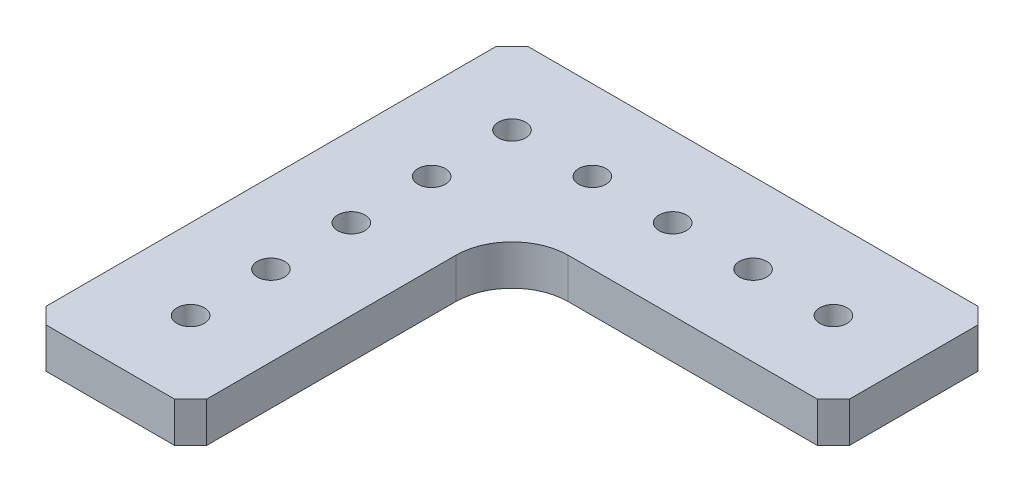
ISO-10303-21;
HEADER;
FILE_DESCRIPTION(('STEP AP214'),'2;1');
FILE_NAME('part.step','',(''),(''),'','','');
FILE_SCHEMA(('AUTOMOTIVE_DESIGN { 1 0 10303 214 1 1 1 1 }'));
ENDSEC;
DATA;
#1=APPLICATION_CONTEXT('core data for automotive mechanical design processes');
#2=APPLICATION_PROTOCOL_DEFINITION('international standard','automotive_design',2000,#1);
#3=PRODUCT_CONTEXT('',#1,'mechanical');
#4=PRODUCT('Part','Part','',(#3));
#5=PRODUCT_RELATED_PRODUCT_CATEGORY('part','',(#4));
#6=PRODUCT_DEFINITION_FORMATION('','',#4);
#7=PRODUCT_DEFINITION_CONTEXT('part definition',#1,'design');
#8=PRODUCT_DEFINITION('design','',#6,#7);
#9=PRODUCT_DEFINITION_SHAPE('','',#8);
#10=(LENGTH_UNIT() NAMED_UNIT(*) SI_UNIT(.MILLI.,.METRE.));
#11=(NAMED_UNIT(*) PLANE_ANGLE_UNIT() SI_UNIT($,.RADIAN.));
#12=(NAMED_UNIT(*) SI_UNIT($,.STERADIAN.) SOLID_ANGLE_UNIT());
#13=UNCERTAINTY_MEASURE_WITH_UNIT(LENGTH_MEASURE(1.E-05),#10,'distance_accuracy_value','');
#14=(GEOMETRIC_REPRESENTATION_CONTEXT(3) GLOBAL_UNCERTAINTY_ASSIGNED_CONTEXT((#13)) GLOBAL_UNIT_ASSIGNED_CONTEXT((#10,
#11,#12)) REPRESENTATION_CONTEXT('',''));
#15=CARTESIAN_POINT('',(0.,0.,0.));
#16=DIRECTION('',(0.,0.,1.));
#17=DIRECTION('',(1.,0.,0.));
#18=AXIS2_PLACEMENT_3D('',#15,#16,#17);
#19=CARTESIAN_POINT('',(-20.5081481481481,6.35,0.));
#20=DIRECTION('',(-1.,0.,0.));
#21=DIRECTION('',(0.,0.,1.));
#22=AXIS2_PLACEMENT_3D('',#19,#20,#21);
#23=PLANE('',#22);
#24=DIRECTION('',(0.,0.,-1.));
#25=VECTOR('',#24,1.);
#26=CARTESIAN_POINT('',(-20.5081481481481,0.,0.));
#27=LINE('',#26,#25);
#28=CARTESIAN_POINT('',(-20.5081481481481,0.,27.892962962963));
#29=VERTEX_POINT('',#28);
#30=CARTESIAN_POINT('',(-20.5081481481481,0.,-11.477037037037));
#31=VERTEX_POINT('',#30);
#32=EDGE_CURVE('E136',#29,#31,#27,.T.);
#33=ORIENTED_EDGE('',*,*,#32,.T.);
#34=DIRECTION('',(0.,-1.,0.));
#35=VECTOR('',#34,1.);
#36=CARTESIAN_POINT('',(-20.5081481481481,6.35,-11.477037037037));
#37=LINE('',#36,#35);
#38=CARTESIAN_POINT('',(-20.5081481481481,6.35,-11.477037037037));
#39=VERTEX_POINT('',#38);
#40=EDGE_CURVE('E58',#31,#39,#37,.F.);
#41=ORIENTED_EDGE('',*,*,#40,.T.);
#42=DIRECTION('',(0.,0.,-1.));
#43=VECTOR('',#42,1.);
#44=CARTESIAN_POINT('',(-20.5081481481481,6.35,0.));
#45=LINE('',#44,#43);
#46=CARTESIAN_POINT('',(-20.5081481481481,6.35,27.892962962963));
#47=VERTEX_POINT('',#46);
#48=EDGE_CURVE('E137',#47,#39,#45,.T.);
#49=ORIENTED_EDGE('',*,*,#48,.F.);
#50=DIRECTION('',(0.,-1.,0.));
#51=VECTOR('',#50,1.);
#52=CARTESIAN_POINT('',(-20.5081481481481,6.35,27.892962962963));
#53=LINE('',#52,#51);
#54=EDGE_CURVE('E131',#47,#29,#53,.T.);
#55=ORIENTED_EDGE('',*,*,#54,.T.);
#56=EDGE_LOOP('',(#33,#41,#49,#55));
#57=FACE_BOUND('',#56,.T.);
#58=ADVANCED_FACE('F37',(#57),#23,.F.);
#59=CARTESIAN_POINT('',(0.,6.35,-20.367037037037));
#60=DIRECTION('',(0.,0.,-1.));
#61=DIRECTION('',(-1.,0.,0.));
#62=AXIS2_PLACEMENT_3D('',#59,#60,#61);
#63=PLANE('',#62);
#64=DIRECTION('',(1.,0.,0.));
#65=VECTOR('',#64,1.);
#66=CARTESIAN_POINT('',(0.,6.35,-20.367037037037));
#67=LINE('',#66,#65);
#68=CARTESIAN_POINT('',(-11.6181481481481,6.35,-20.367037037037));
#69=VERTEX_POINT('',#68);
#70=CARTESIAN_POINT('',(27.7518518518518,6.35,-20.367037037037));
#71=VERTEX_POINT('',#70);
#72=EDGE_CURVE('E212',#69,#71,#67,.T.);
#73=ORIENTED_EDGE('',*,*,#72,.F.);
#74=DIRECTION('',(0.,-1.,0.));
#75=VECTOR('',#74,1.);
#76=CARTESIAN_POINT('',(-11.6181481481481,0.,-20.367037037037));
#77=LINE('',#76,#75);
#78=CARTESIAN_POINT('',(-11.6181481481481,0.,-20.367037037037));
#79=VERTEX_POINT('',#78);
#80=EDGE_CURVE('E205',#69,#79,#77,.T.);
#81=ORIENTED_EDGE('',*,*,#80,.T.);
#82=DIRECTION('',(1.,0.,0.));
#83=VECTOR('',#82,1.);
#84=CARTESIAN_POINT('',(0.,0.,-20.367037037037));
#85=LINE('',#84,#83);
#86=CARTESIAN_POINT('',(27.7518518518518,0.,-20.367037037037));
#87=VERTEX_POINT('',#86);
#88=EDGE_CURVE('E142',#79,#87,#85,.T.);
#89=ORIENTED_EDGE('',*,*,#88,.T.);
#90=DIRECTION('',(0.,1.,0.));
#91=VECTOR('',#90,1.);
#92=CARTESIAN_POINT('',(27.7518518518518,6.35,-20.367037037037));
#93=LINE('',#92,#91);
#94=EDGE_CURVE('E169',#87,#71,#93,.T.);
#95=ORIENTED_EDGE('',*,*,#94,.T.);
#96=EDGE_LOOP('',(#73,#81,#89,#95));
#97=FACE_BOUND('',#96,.T.);
#98=ADVANCED_FACE('F211',(#97),#63,.F.);
#99=CARTESIAN_POINT('',(30.2918518518519,6.35,0.));
#100=DIRECTION('',(1.,0.,0.));
#101=DIRECTION('',(0.,0.,-1.));
#102=AXIS2_PLACEMENT_3D('',#99,#100,#101);
#103=PLANE('',#102);
#104=DIRECTION('',(0.,0.,1.));
#105=VECTOR('',#104,1.);
#106=CARTESIAN_POINT('',(30.2918518518519,0.,0.));
#107=LINE('',#106,#105);
#108=CARTESIAN_POINT('',(30.2918518518519,0.,-43.227037037037));
#109=VERTEX_POINT('',#108);
#110=CARTESIAN_POINT('',(30.2918518518519,0.,-22.907037037037));
#111=VERTEX_POINT('',#110);
#112=EDGE_CURVE('E145',#109,#111,#107,.T.);
#113=ORIENTED_EDGE('',*,*,#112,.F.);
#114=DIRECTION('',(0.,1.,0.));
#115=VECTOR('',#114,1.);
#116=CARTESIAN_POINT('',(30.2918518518519,6.35,-43.227037037037));
#117=LINE('',#116,#115);
#118=CARTESIAN_POINT('',(30.2918518518519,6.35,-43.227037037037));
#119=VERTEX_POINT('',#118);
#120=EDGE_CURVE('E180',#109,#119,#117,.T.);
#121=ORIENTED_EDGE('',*,*,#120,.T.);
#122=DIRECTION('',(0.,0.,1.));
#123=VECTOR('',#122,1.);
#124=CARTESIAN_POINT('',(30.2918518518519,6.35,0.));
#125=LINE('',#124,#123);
#126=CARTESIAN_POINT('',(30.2918518518519,6.35,-22.907037037037));
#127=VERTEX_POINT('',#126);
#128=EDGE_CURVE('E226',#119,#127,#125,.T.);
#129=ORIENTED_EDGE('',*,*,#128,.T.);
#130=DIRECTION('',(0.,-1.,0.));
#131=VECTOR('',#130,1.);
#132=CARTESIAN_POINT('',(30.2918518518519,0.,-22.907037037037));
#133=LINE('',#132,#131);
#134=EDGE_CURVE('E163',#127,#111,#133,.T.);
#135=ORIENTED_EDGE('',*,*,#134,.T.);
#136=EDGE_LOOP('',(#113,#121,#129,#135));
#137=FACE_BOUND('',#136,.T.);
#138=ADVANCED_FACE('F260',(#137),#103,.T.);
#139=CARTESIAN_POINT('',(0.,6.35,-45.767037037037));
#140=DIRECTION('',(0.,0.,-1.));
#141=DIRECTION('',(-1.,0.,0.));
#142=AXIS2_PLACEMENT_3D('',#139,#140,#141);
#143=PLANE('',#142);
#144=DIRECTION('',(1.,0.,0.));
#145=VECTOR('',#144,1.);
#146=CARTESIAN_POINT('',(0.,0.,-45.767037037037));
#147=LINE('',#146,#145);
#148=CARTESIAN_POINT('',(-43.3681481481481,0.,-45.767037037037));
#149=VERTEX_POINT('',#148);
#150=CARTESIAN_POINT('',(27.7518518518519,0.,-45.767037037037));
#151=VERTEX_POINT('',#150);
#152=EDGE_CURVE('E154',#149,#151,#147,.T.);
#153=ORIENTED_EDGE('',*,*,#152,.F.);
#154=DIRECTION('',(0.,1.,0.));
#155=VECTOR('',#154,1.);
#156=CARTESIAN_POINT('',(-43.3681481481481,6.35,-45.767037037037));
#157=LINE('',#156,#155);
#158=CARTESIAN_POINT('',(-43.3681481481481,6.35,-45.767037037037));
#159=VERTEX_POINT('',#158);
#160=EDGE_CURVE('E201',#149,#159,#157,.T.);
#161=ORIENTED_EDGE('',*,*,#160,.T.);
#162=DIRECTION('',(1.,0.,0.));
#163=VECTOR('',#162,1.);
#164=CARTESIAN_POINT('',(0.,6.35,-45.767037037037));
#165=LINE('',#164,#163);
#166=CARTESIAN_POINT('',(27.7518518518519,6.35,-45.767037037037));
#167=VERTEX_POINT('',#166);
#168=EDGE_CURVE('E229',#159,#167,#165,.T.);
#169=ORIENTED_EDGE('',*,*,#168,.T.);
#170=DIRECTION('',(0.,-1.,0.));
#171=VECTOR('',#170,1.);
#172=CARTESIAN_POINT('',(27.7518518518519,6.35,-45.767037037037));
#173=LINE('',#172,#171);
#174=EDGE_CURVE('E175',#167,#151,#173,.T.);
#175=ORIENTED_EDGE('',*,*,#174,.T.);
#176=EDGE_LOOP('',(#153,#161,#169,#175));
#177=FACE_BOUND('',#176,.T.);
#178=ADVANCED_FACE('F254',(#177),#143,.T.);
#179=CARTESIAN_POINT('',(-45.9081481481482,6.35,0.));
#180=DIRECTION('',(1.,0.,0.));
#181=DIRECTION('',(0.,0.,-1.));
#182=AXIS2_PLACEMENT_3D('',#179,#180,#181);
#183=PLANE('',#182);
#184=DIRECTION('',(0.,0.,1.));
#185=VECTOR('',#184,1.);
#186=CARTESIAN_POINT('',(-45.9081481481482,6.35,0.));
#187=LINE('',#186,#185);
#188=CARTESIAN_POINT('',(-45.9081481481482,6.35,-43.2270370370371));
#189=VERTEX_POINT('',#188);
#190=CARTESIAN_POINT('',(-45.9081481481482,6.35,27.8929629629629));
#191=VERTEX_POINT('',#190);
#192=EDGE_CURVE('E234',#189,#191,#187,.T.);
#193=ORIENTED_EDGE('',*,*,#192,.F.);
#194=DIRECTION('',(0.,-1.,0.));
#195=VECTOR('',#194,1.);
#196=CARTESIAN_POINT('',(-45.9081481481482,0.,-43.2270370370371));
#197=LINE('',#196,#195);
#198=CARTESIAN_POINT('',(-45.9081481481482,0.,-43.2270370370371));
#199=VERTEX_POINT('',#198);
#200=EDGE_CURVE('E196',#189,#199,#197,.T.);
#201=ORIENTED_EDGE('',*,*,#200,.T.);
#202=DIRECTION('',(0.,0.,1.));
#203=VECTOR('',#202,1.);
#204=CARTESIAN_POINT('',(-45.9081481481482,0.,0.));
#205=LINE('',#204,#203);
#206=CARTESIAN_POINT('',(-45.9081481481482,0.,27.8929629629629));
#207=VERTEX_POINT('',#206);
#208=EDGE_CURVE('E156',#199,#207,#205,.T.);
#209=ORIENTED_EDGE('',*,*,#208,.T.);
#210=DIRECTION('',(0.,1.,0.));
#211=VECTOR('',#210,1.);
#212=CARTESIAN_POINT('',(-45.9081481481482,6.35,27.8929629629629));
#213=LINE('',#212,#211);
#214=EDGE_CURVE('E191',#207,#191,#213,.T.);
#215=ORIENTED_EDGE('',*,*,#214,.T.);
#216=EDGE_LOOP('',(#193,#201,#209,#215));
#217=FACE_BOUND('',#216,.T.);
#218=ADVANCED_FACE('F245',(#217),#183,.F.);
#219=CARTESIAN_POINT('',(0.,6.35,30.432962962963));
#220=DIRECTION('',(0.,0.,-1.));
#221=DIRECTION('',(-1.,0.,0.));
#222=AXIS2_PLACEMENT_3D('',#219,#220,#221);
#223=PLANE('',#222);
#224=DIRECTION('',(1.,0.,0.));
#225=VECTOR('',#224,1.);
#226=CARTESIAN_POINT('',(0.,6.35,30.432962962963));
#227=LINE('',#226,#225);
#228=CARTESIAN_POINT('',(-43.3681481481482,6.35,30.432962962963));
#229=VERTEX_POINT('',#228);
#230=CARTESIAN_POINT('',(-23.0481481481482,6.35,30.432962962963));
#231=VERTEX_POINT('',#230);
#232=EDGE_CURVE('E138',#229,#231,#227,.T.);
#233=ORIENTED_EDGE('',*,*,#232,.F.);
#234=DIRECTION('',(0.,-1.,0.));
#235=VECTOR('',#234,1.);
#236=CARTESIAN_POINT('',(-43.3681481481482,6.35,30.432962962963));
#237=LINE('',#236,#235);
#238=CARTESIAN_POINT('',(-43.3681481481482,0.,30.432962962963));
#239=VERTEX_POINT('',#238);
#240=EDGE_CURVE('E185',#229,#239,#237,.T.);
#241=ORIENTED_EDGE('',*,*,#240,.T.);
#242=DIRECTION('',(1.,0.,0.));
#243=VECTOR('',#242,1.);
#244=CARTESIAN_POINT('',(0.,0.,30.432962962963));
#245=LINE('',#244,#243);
#246=CARTESIAN_POINT('',(-23.0481481481482,0.,30.432962962963));
#247=VERTEX_POINT('',#246);
#248=EDGE_CURVE('E158',#239,#247,#245,.T.);
#249=ORIENTED_EDGE('',*,*,#248,.T.);
#250=DIRECTION('',(0.,1.,0.));
#251=VECTOR('',#250,1.);
#252=CARTESIAN_POINT('',(-23.0481481481482,6.35,30.432962962963));
#253=LINE('',#252,#251);
#254=EDGE_CURVE('E133',#247,#231,#253,.T.);
#255=ORIENTED_EDGE('',*,*,#254,.T.);
#256=EDGE_LOOP('',(#233,#241,#249,#255));
#257=FACE_BOUND('',#256,.T.);
#258=ADVANCED_FACE('F240',(#257),#223,.F.);
#259=CARTESIAN_POINT('',(0.,6.35,0.));
#260=DIRECTION('',(0.,1.,0.));
#261=DIRECTION('',(0.,0.,1.));
#262=AXIS2_PLACEMENT_3D('',#259,#260,#261);
#263=PLANE('',#262);
#264=CARTESIAN_POINT('',(-33.2081481481478,6.35,17.7329629629629));
#265=DIRECTION('',(0.,1.,0.));
#266=DIRECTION('',(0.,0.,1.));
#267=AXIS2_PLACEMENT_3D('',#264,#265,#266);
#268=CIRCLE('',#267,2.159);
#269=CARTESIAN_POINT('',(-33.2081481481478,6.35,19.8919629629629));
#270=VERTEX_POINT('',#269);
#271=EDGE_CURVE('E491',#270,#270,#268,.T.);
#272=ORIENTED_EDGE('',*,*,#271,.F.);
#273=EDGE_LOOP('',(#272));
#274=FACE_BOUND('',#273,.T.);
#275=CARTESIAN_POINT('',(-33.2081481481479,6.35,5.03296296296295));
#276=DIRECTION('',(0.,1.,0.));
#277=DIRECTION('',(0.,0.,1.));
#278=AXIS2_PLACEMENT_3D('',#275,#276,#277);
#279=CIRCLE('',#278,2.159);
#280=CARTESIAN_POINT('',(-33.2081481481479,6.35,7.19196296296295));
#281=VERTEX_POINT('',#280);
#282=EDGE_CURVE('E495',#281,#281,#279,.T.);
#283=ORIENTED_EDGE('',*,*,#282,.F.);
#284=EDGE_LOOP('',(#283));
#285=FACE_BOUND('',#284,.T.);
#286=CARTESIAN_POINT('',(-33.208148148148,6.35,-7.66703703703705));
#287=DIRECTION('',(0.,1.,0.));
#288=DIRECTION('',(0.,0.,1.));
#289=AXIS2_PLACEMENT_3D('',#286,#287,#288);
#290=CIRCLE('',#289,2.159);
#291=CARTESIAN_POINT('',(-33.208148148148,6.35,-5.50803703703705));
#292=VERTEX_POINT('',#291);
#293=EDGE_CURVE('E534',#292,#292,#290,.T.);
#294=ORIENTED_EDGE('',*,*,#293,.F.);
#295=EDGE_LOOP('',(#294));
#296=FACE_BOUND('',#295,.T.);
#297=CARTESIAN_POINT('',(-33.2081481481482,6.35,-20.367037037037));
#298=DIRECTION('',(0.,1.,0.));
#299=DIRECTION('',(0.,0.,1.));
#300=AXIS2_PLACEMENT_3D('',#297,#298,#299);
#301=CIRCLE('',#300,2.159);
#302=CARTESIAN_POINT('',(-33.2081481481482,6.35,-18.208037037037));
#303=VERTEX_POINT('',#302);
#304=EDGE_CURVE('E528',#303,#303,#301,.T.);
#305=ORIENTED_EDGE('',*,*,#304,.F.);
#306=EDGE_LOOP('',(#305));
#307=FACE_BOUND('',#306,.T.);
#308=CARTESIAN_POINT('',(17.5918518518518,6.35,-33.067037037037));
#309=DIRECTION('',(0.,1.,0.));
#310=DIRECTION('',(0.,0.,1.));
#311=AXIS2_PLACEMENT_3D('',#308,#309,#310);
#312=CIRCLE('',#311,2.159);
#313=CARTESIAN_POINT('',(17.5918518518518,6.35,-30.908037037037));
#314=VERTEX_POINT('',#313);
#315=EDGE_CURVE('E522',#314,#314,#312,.T.);
#316=ORIENTED_EDGE('',*,*,#315,.F.);
#317=EDGE_LOOP('',(#316));
#318=FACE_BOUND('',#317,.T.);
#319=CARTESIAN_POINT('',(4.89185185185184,6.35,-33.067037037037));
#320=DIRECTION('',(0.,1.,0.));
#321=DIRECTION('',(0.,0.,1.));
#322=AXIS2_PLACEMENT_3D('',#319,#320,#321);
#323=CIRCLE('',#322,2.159);
#324=CARTESIAN_POINT('',(4.89185185185184,6.35,-30.908037037037));
#325=VERTEX_POINT('',#324);
#326=EDGE_CURVE('E516',#325,#325,#323,.T.);
#327=ORIENTED_EDGE('',*,*,#326,.F.);
#328=EDGE_LOOP('',(#327));
#329=FACE_BOUND('',#328,.T.);
#330=CARTESIAN_POINT('',(-7.80814814814815,6.35,-33.067037037037));
#331=DIRECTION('',(0.,1.,0.));
#332=DIRECTION('',(0.,0.,1.));
#333=AXIS2_PLACEMENT_3D('',#330,#331,#332);
#334=CIRCLE('',#333,2.159);
#335=CARTESIAN_POINT('',(-7.80814814814815,6.35,-30.908037037037));
#336=VERTEX_POINT('',#335);
#337=EDGE_CURVE('E508',#336,#336,#334,.T.);
#338=ORIENTED_EDGE('',*,*,#337,.F.);
#339=EDGE_LOOP('',(#338));
#340=FACE_BOUND('',#339,.T.);
#341=CARTESIAN_POINT('',(-20.5081481481482,6.35,-33.067037037037));
#342=DIRECTION('',(0.,1.,0.));
#343=DIRECTION('',(0.,0.,1.));
#344=AXIS2_PLACEMENT_3D('',#341,#342,#343);
#345=CIRCLE('',#344,2.159);
#346=CARTESIAN_POINT('',(-20.5081481481482,6.35,-30.908037037037));
#347=VERTEX_POINT('',#346);
#348=EDGE_CURVE('E500',#347,#347,#345,.T.);
#349=ORIENTED_EDGE('',*,*,#348,.F.);
#350=EDGE_LOOP('',(#349));
#351=FACE_BOUND('',#350,.T.);
#352=CARTESIAN_POINT('',(-33.2081481481482,6.35,-33.067037037037));
#353=DIRECTION('',(0.,1.,0.));
#354=DIRECTION('',(0.,0.,1.));
#355=AXIS2_PLACEMENT_3D('',#352,#353,#354);
#356=CIRCLE('',#355,2.159);
#357=CARTESIAN_POINT('',(-33.2081481481482,6.35,-30.908037037037));
#358=VERTEX_POINT('',#357);
#359=EDGE_CURVE('E148',#358,#358,#356,.T.);
#360=ORIENTED_EDGE('',*,*,#359,.F.);
#361=EDGE_LOOP('',(#360));
#362=FACE_BOUND('',#361,.T.);
#363=ORIENTED_EDGE('',*,*,#168,.F.);
#364=DIRECTION('',(-0.70710678118655,0.,0.707106781186546));
#365=VECTOR('',#364,1.);
#366=CARTESIAN_POINT('',(-44.5675925925925,6.35,-44.5675925925927));
#367=LINE('',#366,#365);
#368=EDGE_CURVE('E203',#159,#189,#367,.T.);
#369=ORIENTED_EDGE('',*,*,#368,.T.);
#370=ORIENTED_EDGE('',*,*,#192,.T.);
#371=DIRECTION('',(-0.707106781186546,0.,-0.70710678118655));
#372=VECTOR('',#371,1.);
#373=CARTESIAN_POINT('',(-36.9005555555557,6.35,36.9005555555555));
#374=LINE('',#373,#372);
#375=EDGE_CURVE('E194',#191,#229,#374,.F.);
#376=ORIENTED_EDGE('',*,*,#375,.T.);
#377=ORIENTED_EDGE('',*,*,#232,.T.);
#378=DIRECTION('',(-0.70710678118655,0.,0.707106781186546));
#379=VECTOR('',#378,1.);
#380=CARTESIAN_POINT('',(3.69240740740747,6.35,3.69240740740749));
#381=LINE('',#380,#379);
#382=EDGE_CURVE('E161',#231,#47,#381,.F.);
#383=ORIENTED_EDGE('',*,*,#382,.T.);
#384=ORIENTED_EDGE('',*,*,#48,.T.);
#385=CARTESIAN_POINT('',(-11.6181481481481,6.35,-11.477037037037));
#386=DIRECTION('',(0.,1.,0.));
#387=DIRECTION('',(0.,0.,1.));
#388=AXIS2_PLACEMENT_3D('',#385,#386,#387);
#389=CIRCLE('',#388,8.89);
#390=EDGE_CURVE('E11',#39,#69,#389,.F.);
#391=ORIENTED_EDGE('',*,*,#390,.T.);
#392=ORIENTED_EDGE('',*,*,#72,.T.);
#393=DIRECTION('',(0.70710678118655,0.,-0.707106781186546));
#394=VECTOR('',#393,1.);
#395=CARTESIAN_POINT('',(3.69240740740732,6.35,3.69240740740734));
#396=LINE('',#395,#394);
#397=EDGE_CURVE('E172',#71,#127,#396,.T.);
#398=ORIENTED_EDGE('',*,*,#397,.T.);
#399=ORIENTED_EDGE('',*,*,#128,.F.);
#400=DIRECTION('',(0.707106781186546,0.,0.70710678118655));
#401=VECTOR('',#400,1.);
#402=CARTESIAN_POINT('',(36.7594444444445,6.35,-36.7594444444443));
#403=LINE('',#402,#401);
#404=EDGE_CURVE('E182',#119,#167,#403,.F.);
#405=ORIENTED_EDGE('',*,*,#404,.T.);
#406=EDGE_LOOP('',(#363,#369,#370,#376,#377,#383,#384,#391,#392,#398,#399,#405));
#407=FACE_BOUND('',#406,.T.);
#408=ADVANCED_FACE('F225',(#274,#285,#296,#307,#318,#329,#340,#351,#362,#407),#263,.T.);
#409=CARTESIAN_POINT('',(0.,0.,0.));
#410=DIRECTION('',(0.,1.,0.));
#411=DIRECTION('',(0.,0.,1.));
#412=AXIS2_PLACEMENT_3D('',#409,#410,#411);
#413=PLANE('',#412);
#414=CARTESIAN_POINT('',(-33.2081481481478,0.,17.7329629629629));
#415=DIRECTION('',(0.,1.,0.));
#416=DIRECTION('',(0.,0.,1.));
#417=AXIS2_PLACEMENT_3D('',#414,#415,#416);
#418=CIRCLE('',#417,2.159);
#419=CARTESIAN_POINT('',(-33.2081481481478,0.,19.8919629629629));
#420=VERTEX_POINT('',#419);
#421=EDGE_CURVE('E488',#420,#420,#418,.T.);
#422=ORIENTED_EDGE('',*,*,#421,.T.);
#423=EDGE_LOOP('',(#422));
#424=FACE_BOUND('',#423,.T.);
#425=CARTESIAN_POINT('',(-33.2081481481479,0.,5.03296296296295));
#426=DIRECTION('',(0.,1.,0.));
#427=DIRECTION('',(0.,0.,1.));
#428=AXIS2_PLACEMENT_3D('',#425,#426,#427);
#429=CIRCLE('',#428,2.159);
#430=CARTESIAN_POINT('',(-33.2081481481479,0.,7.19196296296295));
#431=VERTEX_POINT('',#430);
#432=EDGE_CURVE('E492',#431,#431,#429,.T.);
#433=ORIENTED_EDGE('',*,*,#432,.T.);
#434=EDGE_LOOP('',(#433));
#435=FACE_BOUND('',#434,.T.);
#436=CARTESIAN_POINT('',(-33.208148148148,0.,-7.66703703703705));
#437=DIRECTION('',(0.,1.,0.));
#438=DIRECTION('',(0.,0.,1.));
#439=AXIS2_PLACEMENT_3D('',#436,#437,#438);
#440=CIRCLE('',#439,2.159);
#441=CARTESIAN_POINT('',(-33.208148148148,0.,-5.50803703703705));
#442=VERTEX_POINT('',#441);
#443=EDGE_CURVE('E537',#442,#442,#440,.T.);
#444=ORIENTED_EDGE('',*,*,#443,.T.);
#445=EDGE_LOOP('',(#444));
#446=FACE_BOUND('',#445,.T.);
#447=CARTESIAN_POINT('',(-33.2081481481482,0.,-20.367037037037));
#448=DIRECTION('',(0.,1.,0.));
#449=DIRECTION('',(0.,0.,1.));
#450=AXIS2_PLACEMENT_3D('',#447,#448,#449);
#451=CIRCLE('',#450,2.159);
#452=CARTESIAN_POINT('',(-33.2081481481482,0.,-18.208037037037));
#453=VERTEX_POINT('',#452);
#454=EDGE_CURVE('E531',#453,#453,#451,.T.);
#455=ORIENTED_EDGE('',*,*,#454,.T.);
#456=EDGE_LOOP('',(#455));
#457=FACE_BOUND('',#456,.T.);
#458=CARTESIAN_POINT('',(17.5918518518518,0.,-33.067037037037));
#459=DIRECTION('',(0.,1.,0.));
#460=DIRECTION('',(0.,0.,1.));
#461=AXIS2_PLACEMENT_3D('',#458,#459,#460);
#462=CIRCLE('',#461,2.159);
#463=CARTESIAN_POINT('',(17.5918518518518,0.,-30.908037037037));
#464=VERTEX_POINT('',#463);
#465=EDGE_CURVE('E525',#464,#464,#462,.T.);
#466=ORIENTED_EDGE('',*,*,#465,.T.);
#467=EDGE_LOOP('',(#466));
#468=FACE_BOUND('',#467,.T.);
#469=CARTESIAN_POINT('',(4.89185185185184,0.,-33.067037037037));
#470=DIRECTION('',(0.,1.,0.));
#471=DIRECTION('',(0.,0.,1.));
#472=AXIS2_PLACEMENT_3D('',#469,#470,#471);
#473=CIRCLE('',#472,2.159);
#474=CARTESIAN_POINT('',(4.89185185185184,0.,-30.908037037037));
#475=VERTEX_POINT('',#474);
#476=EDGE_CURVE('E519',#475,#475,#473,.T.);
#477=ORIENTED_EDGE('',*,*,#476,.T.);
#478=EDGE_LOOP('',(#477));
#479=FACE_BOUND('',#478,.T.);
#480=CARTESIAN_POINT('',(-7.80814814814815,0.,-33.067037037037));
#481=DIRECTION('',(0.,1.,0.));
#482=DIRECTION('',(0.,0.,1.));
#483=AXIS2_PLACEMENT_3D('',#480,#481,#482);
#484=CIRCLE('',#483,2.159);
#485=CARTESIAN_POINT('',(-7.80814814814815,0.,-30.908037037037));
#486=VERTEX_POINT('',#485);
#487=EDGE_CURVE('E513',#486,#486,#484,.T.);
#488=ORIENTED_EDGE('',*,*,#487,.T.);
#489=EDGE_LOOP('',(#488));
#490=FACE_BOUND('',#489,.T.);
#491=CARTESIAN_POINT('',(-20.5081481481482,0.,-33.067037037037));
#492=DIRECTION('',(0.,1.,0.));
#493=DIRECTION('',(0.,0.,1.));
#494=AXIS2_PLACEMENT_3D('',#491,#492,#493);
#495=CIRCLE('',#494,2.159);
#496=CARTESIAN_POINT('',(-20.5081481481482,0.,-30.908037037037));
#497=VERTEX_POINT('',#496);
#498=EDGE_CURVE('E503',#497,#497,#495,.T.);
#499=ORIENTED_EDGE('',*,*,#498,.T.);
#500=EDGE_LOOP('',(#499));
#501=FACE_BOUND('',#500,.T.);
#502=CARTESIAN_POINT('',(-33.2081481481482,0.,-33.067037037037));
#503=DIRECTION('',(0.,1.,0.));
#504=DIRECTION('',(0.,0.,1.));
#505=AXIS2_PLACEMENT_3D('',#502,#503,#504);
#506=CIRCLE('',#505,2.159);
#507=CARTESIAN_POINT('',(-33.2081481481482,0.,-30.908037037037));
#508=VERTEX_POINT('',#507);
#509=EDGE_CURVE('E143',#508,#508,#506,.T.);
#510=ORIENTED_EDGE('',*,*,#509,.T.);
#511=EDGE_LOOP('',(#510));
#512=FACE_BOUND('',#511,.T.);
#513=ORIENTED_EDGE('',*,*,#208,.F.);
#514=DIRECTION('',(0.70710678118655,0.,-0.707106781186546));
#515=VECTOR('',#514,1.);
#516=CARTESIAN_POINT('',(-45.9081481481482,0.,-43.2270370370371));
#517=LINE('',#516,#515);
#518=EDGE_CURVE('E199',#199,#149,#517,.T.);
#519=ORIENTED_EDGE('',*,*,#518,.T.);
#520=ORIENTED_EDGE('',*,*,#152,.T.);
#521=DIRECTION('',(-0.707106781186546,0.,-0.70710678118655));
#522=VECTOR('',#521,1.);
#523=CARTESIAN_POINT('',(27.7518518518519,0.,-45.767037037037));
#524=LINE('',#523,#522);
#525=EDGE_CURVE('E178',#151,#109,#524,.F.);
#526=ORIENTED_EDGE('',*,*,#525,.T.);
#527=ORIENTED_EDGE('',*,*,#112,.T.);
#528=DIRECTION('',(-0.70710678118655,0.,0.707106781186546));
#529=VECTOR('',#528,1.);
#530=CARTESIAN_POINT('',(30.2918518518519,0.,-22.907037037037));
#531=LINE('',#530,#529);
#532=EDGE_CURVE('E166',#111,#87,#531,.T.);
#533=ORIENTED_EDGE('',*,*,#532,.T.);
#534=ORIENTED_EDGE('',*,*,#88,.F.);
#535=CARTESIAN_POINT('',(-11.6181481481481,0.,-11.477037037037));
#536=DIRECTION('',(0.,1.,0.));
#537=DIRECTION('',(0.,0.,1.));
#538=AXIS2_PLACEMENT_3D('',#535,#536,#537);
#539=CIRCLE('',#538,8.89);
#540=EDGE_CURVE('E45',#79,#31,#539,.T.);
#541=ORIENTED_EDGE('',*,*,#540,.T.);
#542=ORIENTED_EDGE('',*,*,#32,.F.);
#543=DIRECTION('',(0.70710678118655,0.,-0.707106781186546));
#544=VECTOR('',#543,1.);
#545=CARTESIAN_POINT('',(-20.5081481481481,0.,27.892962962963));
#546=LINE('',#545,#544);
#547=EDGE_CURVE('E127',#29,#247,#546,.F.);
#548=ORIENTED_EDGE('',*,*,#547,.T.);
#549=ORIENTED_EDGE('',*,*,#248,.F.);
#550=DIRECTION('',(0.707106781186546,0.,0.70710678118655));
#551=VECTOR('',#550,1.);
#552=CARTESIAN_POINT('',(-43.3681481481482,0.,30.432962962963));
#553=LINE('',#552,#551);
#554=EDGE_CURVE('E188',#239,#207,#553,.F.);
#555=ORIENTED_EDGE('',*,*,#554,.T.);
#556=EDGE_LOOP('',(#513,#519,#520,#526,#527,#533,#534,#541,#542,#548,#549,#555));
#557=FACE_BOUND('',#556,.T.);
#558=ADVANCED_FACE('F141',(#424,#435,#446,#457,#468,#479,#490,#501,#512,#557),#413,.F.);
#559=CARTESIAN_POINT('',(-20.5081481481481,6.35,27.892962962963));
#560=DIRECTION('',(-0.707106781186546,0.,-0.70710678118655));
#561=DIRECTION('',(0.,-1.,0.));
#562=AXIS2_PLACEMENT_3D('',#559,#560,#561);
#563=PLANE('',#562);
#564=ORIENTED_EDGE('',*,*,#382,.F.);
#565=ORIENTED_EDGE('',*,*,#254,.F.);
#566=ORIENTED_EDGE('',*,*,#547,.F.);
#567=ORIENTED_EDGE('',*,*,#54,.F.);
#568=EDGE_LOOP('',(#564,#565,#566,#567));
#569=FACE_BOUND('',#568,.T.);
#570=ADVANCED_FACE('F130',(#569),#563,.F.);
#571=CARTESIAN_POINT('',(30.2918518518519,6.35,-22.907037037037));
#572=DIRECTION('',(0.707106781186546,0.,0.70710678118655));
#573=DIRECTION('',(0.,1.,0.));
#574=AXIS2_PLACEMENT_3D('',#571,#572,#573);
#575=PLANE('',#574);
#576=ORIENTED_EDGE('',*,*,#397,.F.);
#577=ORIENTED_EDGE('',*,*,#94,.F.);
#578=ORIENTED_EDGE('',*,*,#532,.F.);
#579=ORIENTED_EDGE('',*,*,#134,.F.);
#580=EDGE_LOOP('',(#576,#577,#578,#579));
#581=FACE_BOUND('',#580,.T.);
#582=ADVANCED_FACE('F221',(#581),#575,.T.);
#583=CARTESIAN_POINT('',(27.7518518518519,6.35,-45.767037037037));
#584=DIRECTION('',(-0.70710678118655,0.,0.707106781186546));
#585=DIRECTION('',(0.,-1.,0.));
#586=AXIS2_PLACEMENT_3D('',#583,#584,#585);
#587=PLANE('',#586);
#588=ORIENTED_EDGE('',*,*,#404,.F.);
#589=ORIENTED_EDGE('',*,*,#120,.F.);
#590=ORIENTED_EDGE('',*,*,#525,.F.);
#591=ORIENTED_EDGE('',*,*,#174,.F.);
#592=EDGE_LOOP('',(#588,#589,#590,#591));
#593=FACE_BOUND('',#592,.T.);
#594=ADVANCED_FACE('F257',(#593),#587,.F.);
#595=CARTESIAN_POINT('',(-43.3681481481482,6.35,30.432962962963));
#596=DIRECTION('',(0.70710678118655,0.,-0.707106781186546));
#597=DIRECTION('',(0.,-1.,0.));
#598=AXIS2_PLACEMENT_3D('',#595,#596,#597);
#599=PLANE('',#598);
#600=ORIENTED_EDGE('',*,*,#375,.F.);
#601=ORIENTED_EDGE('',*,*,#214,.F.);
#602=ORIENTED_EDGE('',*,*,#554,.F.);
#603=ORIENTED_EDGE('',*,*,#240,.F.);
#604=EDGE_LOOP('',(#600,#601,#602,#603));
#605=FACE_BOUND('',#604,.T.);
#606=ADVANCED_FACE('F243',(#605),#599,.F.);
#607=CARTESIAN_POINT('',(-45.9081481481482,6.35,-43.2270370370371));
#608=DIRECTION('',(-0.707106781186546,0.,-0.70710678118655));
#609=DIRECTION('',(0.,1.,0.));
#610=AXIS2_PLACEMENT_3D('',#607,#608,#609);
#611=PLANE('',#610);
#612=ORIENTED_EDGE('',*,*,#368,.F.);
#613=ORIENTED_EDGE('',*,*,#160,.F.);
#614=ORIENTED_EDGE('',*,*,#518,.F.);
#615=ORIENTED_EDGE('',*,*,#200,.F.);
#616=EDGE_LOOP('',(#612,#613,#614,#615));
#617=FACE_BOUND('',#616,.T.);
#618=ADVANCED_FACE('F249',(#617),#611,.T.);
#619=CARTESIAN_POINT('',(-11.6181481481481,6.35,-11.477037037037));
#620=DIRECTION('',(0.,1.,0.));
#621=DIRECTION('',(0.,0.,1.));
#622=AXIS2_PLACEMENT_3D('',#619,#620,#621);
#623=CYLINDRICAL_SURFACE('',#622,8.89);
#624=ORIENTED_EDGE('',*,*,#390,.F.);
#625=ORIENTED_EDGE('',*,*,#40,.F.);
#626=ORIENTED_EDGE('',*,*,#540,.F.);
#627=ORIENTED_EDGE('',*,*,#80,.F.);
#628=EDGE_LOOP('',(#624,#625,#626,#627));
#629=FACE_BOUND('',#628,.T.);
#630=ADVANCED_FACE('F39',(#629),#623,.F.);
#631=CARTESIAN_POINT('',(-33.2081481481482,0.,-33.067037037037));
#632=DIRECTION('',(0.,1.,0.));
#633=DIRECTION('',(0.,0.,1.));
#634=AXIS2_PLACEMENT_3D('',#631,#632,#633);
#635=CYLINDRICAL_SURFACE('',#634,2.159);
#636=ORIENTED_EDGE('',*,*,#509,.F.);
#637=EDGE_LOOP('',(#636));
#638=FACE_BOUND('',#637,.T.);
#639=ORIENTED_EDGE('',*,*,#359,.T.);
#640=EDGE_LOOP('',(#639));
#641=FACE_BOUND('',#640,.T.);
#642=ADVANCED_FACE('F300',(#638,#641),#635,.F.);
#643=CARTESIAN_POINT('',(-20.5081481481482,0.,-33.067037037037));
#644=DIRECTION('',(0.,1.,0.));
#645=DIRECTION('',(0.,0.,1.));
#646=AXIS2_PLACEMENT_3D('',#643,#644,#645);
#647=CYLINDRICAL_SURFACE('',#646,2.159);
#648=ORIENTED_EDGE('',*,*,#498,.F.);
#649=EDGE_LOOP('',(#648));
#650=FACE_BOUND('',#649,.T.);
#651=ORIENTED_EDGE('',*,*,#348,.T.);
#652=EDGE_LOOP('',(#651));
#653=FACE_BOUND('',#652,.T.);
#654=ADVANCED_FACE('F304',(#650,#653),#647,.F.);
#655=CARTESIAN_POINT('',(-7.80814814814815,0.,-33.067037037037));
#656=DIRECTION('',(0.,1.,0.));
#657=DIRECTION('',(0.,0.,1.));
#658=AXIS2_PLACEMENT_3D('',#655,#656,#657);
#659=CYLINDRICAL_SURFACE('',#658,2.159);
#660=ORIENTED_EDGE('',*,*,#487,.F.);
#661=EDGE_LOOP('',(#660));
#662=FACE_BOUND('',#661,.T.);
#663=ORIENTED_EDGE('',*,*,#337,.T.);
#664=EDGE_LOOP('',(#663));
#665=FACE_BOUND('',#664,.T.);
#666=ADVANCED_FACE('F310',(#662,#665),#659,.F.);
#667=CARTESIAN_POINT('',(4.89185185185184,0.,-33.067037037037));
#668=DIRECTION('',(0.,1.,0.));
#669=DIRECTION('',(0.,0.,1.));
#670=AXIS2_PLACEMENT_3D('',#667,#668,#669);
#671=CYLINDRICAL_SURFACE('',#670,2.159);
#672=ORIENTED_EDGE('',*,*,#476,.F.);
#673=EDGE_LOOP('',(#672));
#674=FACE_BOUND('',#673,.T.);
#675=ORIENTED_EDGE('',*,*,#326,.T.);
#676=EDGE_LOOP('',(#675));
#677=FACE_BOUND('',#676,.T.);
#678=ADVANCED_FACE('F424',(#674,#677),#671,.F.);
#679=CARTESIAN_POINT('',(17.5918518518518,0.,-33.067037037037));
#680=DIRECTION('',(0.,1.,0.));
#681=DIRECTION('',(0.,0.,1.));
#682=AXIS2_PLACEMENT_3D('',#679,#680,#681);
#683=CYLINDRICAL_SURFACE('',#682,2.159);
#684=ORIENTED_EDGE('',*,*,#465,.F.);
#685=EDGE_LOOP('',(#684));
#686=FACE_BOUND('',#685,.T.);
#687=ORIENTED_EDGE('',*,*,#315,.T.);
#688=EDGE_LOOP('',(#687));
#689=FACE_BOUND('',#688,.T.);
#690=ADVANCED_FACE('F433',(#686,#689),#683,.F.);
#691=CARTESIAN_POINT('',(-33.2081481481482,0.,-20.367037037037));
#692=DIRECTION('',(0.,1.,0.));
#693=DIRECTION('',(0.,0.,1.));
#694=AXIS2_PLACEMENT_3D('',#691,#692,#693);
#695=CYLINDRICAL_SURFACE('',#694,2.159);
#696=ORIENTED_EDGE('',*,*,#454,.F.);
#697=EDGE_LOOP('',(#696));
#698=FACE_BOUND('',#697,.T.);
#699=ORIENTED_EDGE('',*,*,#304,.T.);
#700=EDGE_LOOP('',(#699));
#701=FACE_BOUND('',#700,.T.);
#702=ADVANCED_FACE('F442',(#698,#701),#695,.F.);
#703=CARTESIAN_POINT('',(-33.208148148148,0.,-7.66703703703705));
#704=DIRECTION('',(0.,1.,0.));
#705=DIRECTION('',(0.,0.,1.));
#706=AXIS2_PLACEMENT_3D('',#703,#704,#705);
#707=CYLINDRICAL_SURFACE('',#706,2.159);
#708=ORIENTED_EDGE('',*,*,#443,.F.);
#709=EDGE_LOOP('',(#708));
#710=FACE_BOUND('',#709,.T.);
#711=ORIENTED_EDGE('',*,*,#293,.T.);
#712=EDGE_LOOP('',(#711));
#713=FACE_BOUND('',#712,.T.);
#714=ADVANCED_FACE('F451',(#710,#713),#707,.F.);
#715=CARTESIAN_POINT('',(-33.2081481481479,0.,5.03296296296295));
#716=DIRECTION('',(0.,1.,0.));
#717=DIRECTION('',(0.,0.,1.));
#718=AXIS2_PLACEMENT_3D('',#715,#716,#717);
#719=CYLINDRICAL_SURFACE('',#718,2.159);
#720=ORIENTED_EDGE('',*,*,#432,.F.);
#721=EDGE_LOOP('',(#720));
#722=FACE_BOUND('',#721,.T.);
#723=ORIENTED_EDGE('',*,*,#282,.T.);
#724=EDGE_LOOP('',(#723));
#725=FACE_BOUND('',#724,.T.);
#726=ADVANCED_FACE('F460',(#722,#725),#719,.F.);
#727=CARTESIAN_POINT('',(-33.2081481481478,0.,17.7329629629629));
#728=DIRECTION('',(0.,1.,0.));
#729=DIRECTION('',(0.,0.,1.));
#730=AXIS2_PLACEMENT_3D('',#727,#728,#729);
#731=CYLINDRICAL_SURFACE('',#730,2.159);
#732=ORIENTED_EDGE('',*,*,#421,.F.);
#733=EDGE_LOOP('',(#732));
#734=FACE_BOUND('',#733,.T.);
#735=ORIENTED_EDGE('',*,*,#271,.T.);
#736=EDGE_LOOP('',(#735));
#737=FACE_BOUND('',#736,.T.);
#738=ADVANCED_FACE('F317',(#734,#737),#731,.F.);
#739=CLOSED_SHELL('',(#58,#98,#138,#178,#218,#258,#408,#558,#570,#582,#594,#606,#618,#630,#642,
#654,#666,#678,#690,#702,#714,#726,#738));
#740=MANIFOLD_SOLID_BREP('B2',#739);
#741=ADVANCED_BREP_SHAPE_REPRESENTATION('',(#18,#740),#14);
#742=SHAPE_DEFINITION_REPRESENTATION(#9,#741);
ENDSEC;
END-ISO-10303-21;
